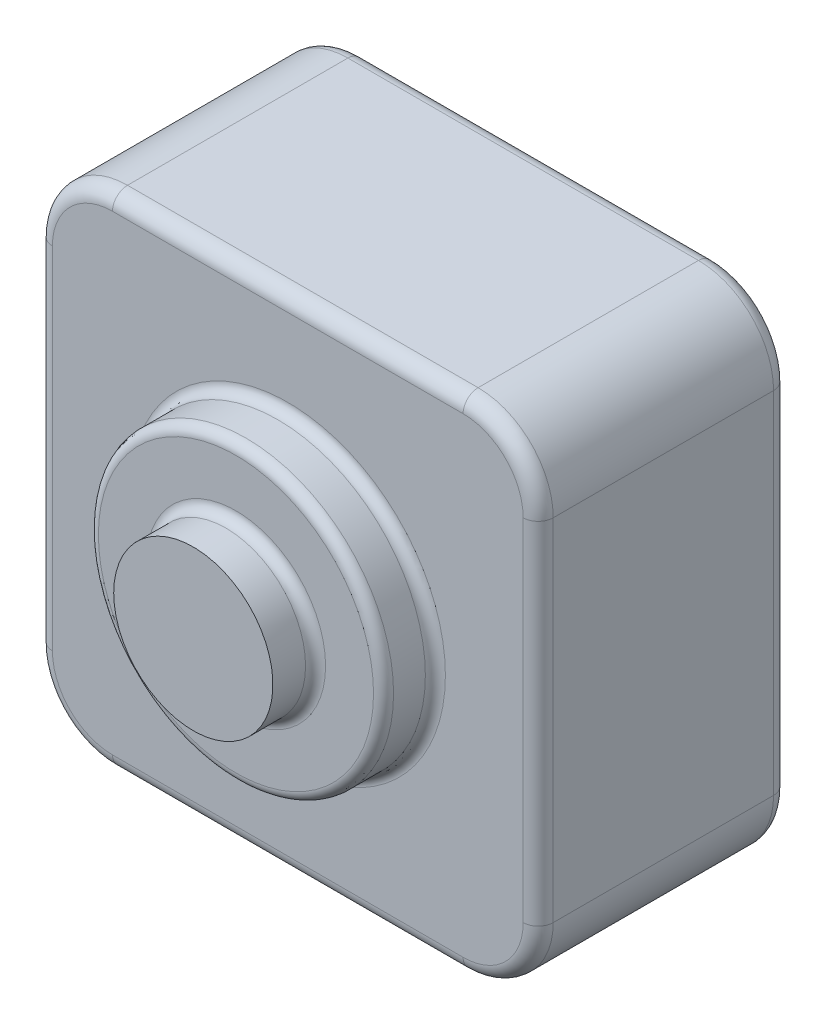
ISO-10303-21;
HEADER;
FILE_DESCRIPTION(('STEP AP214'),'2;1');
FILE_NAME('part.step','',(''),(''),'','','');
FILE_SCHEMA(('AUTOMOTIVE_DESIGN { 1 0 10303 214 1 1 1 1 }'));
ENDSEC;
DATA;
#1=APPLICATION_CONTEXT('core data for automotive mechanical design processes');
#2=APPLICATION_PROTOCOL_DEFINITION('international standard','automotive_design',2000,#1);
#3=PRODUCT_CONTEXT('',#1,'mechanical');
#4=PRODUCT('Part','Part','',(#3));
#5=PRODUCT_RELATED_PRODUCT_CATEGORY('part','',(#4));
#6=PRODUCT_DEFINITION_FORMATION('','',#4);
#7=PRODUCT_DEFINITION_CONTEXT('part definition',#1,'design');
#8=PRODUCT_DEFINITION('design','',#6,#7);
#9=PRODUCT_DEFINITION_SHAPE('','',#8);
#10=(LENGTH_UNIT() NAMED_UNIT(*) SI_UNIT(.MILLI.,.METRE.));
#11=(NAMED_UNIT(*) PLANE_ANGLE_UNIT() SI_UNIT($,.RADIAN.));
#12=(NAMED_UNIT(*) SI_UNIT($,.STERADIAN.) SOLID_ANGLE_UNIT());
#13=UNCERTAINTY_MEASURE_WITH_UNIT(LENGTH_MEASURE(1.E-05),#10,'distance_accuracy_value','');
#14=(GEOMETRIC_REPRESENTATION_CONTEXT(3) GLOBAL_UNCERTAINTY_ASSIGNED_CONTEXT((#13)) GLOBAL_UNIT_ASSIGNED_CONTEXT((#10,
#11,#12)) REPRESENTATION_CONTEXT('',''));
#15=CARTESIAN_POINT('',(0.,0.,0.));
#16=DIRECTION('',(0.,0.,1.));
#17=DIRECTION('',(1.,0.,0.));
#18=AXIS2_PLACEMENT_3D('',#15,#16,#17);
#19=CARTESIAN_POINT('',(0.,0.,68.869639975));
#20=DIRECTION('',(0.,0.,1.));
#21=DIRECTION('',(1.,0.,0.));
#22=AXIS2_PLACEMENT_3D('',#19,#20,#21);
#23=PLANE('',#22);
#24=CARTESIAN_POINT('',(0.,0.,68.869639975));
#25=DIRECTION('',(0.,0.,-1.));
#26=DIRECTION('',(-1.,0.,0.));
#27=AXIS2_PLACEMENT_3D('',#24,#25,#26);
#28=CIRCLE('',#27,15.894503155);
#29=CARTESIAN_POINT('',(-15.894503155,0.,68.869639975));
#30=VERTEX_POINT('',#29);
#31=EDGE_CURVE('E226',#30,#30,#28,.T.);
#32=ORIENTED_EDGE('',*,*,#31,.F.);
#33=EDGE_LOOP('',(#32));
#34=FACE_BOUND('',#33,.T.);
#35=ADVANCED_FACE('F17',(#34),#23,.T.);
#36=CARTESIAN_POINT('',(0.,0.,68.869639975));
#37=DIRECTION('',(0.,0.,-1.));
#38=DIRECTION('',(-1.,0.,0.));
#39=AXIS2_PLACEMENT_3D('',#36,#37,#38);
#40=CYLINDRICAL_SURFACE('',#39,15.894503155);
#41=CARTESIAN_POINT('',(0.,0.,62.348961555));
#42=DIRECTION('',(0.,0.,1.));
#43=DIRECTION('',(1.,0.,0.));
#44=AXIS2_PLACEMENT_3D('',#41,#42,#43);
#45=CIRCLE('',#44,15.894503155);
#46=CARTESIAN_POINT('',(15.894503155,0.,62.348961555));
#47=VERTEX_POINT('',#46);
#48=EDGE_CURVE('E153',#47,#47,#45,.T.);
#49=ORIENTED_EDGE('',*,*,#48,.T.);
#50=EDGE_LOOP('',(#49));
#51=FACE_BOUND('',#50,.T.);
#52=ORIENTED_EDGE('',*,*,#31,.T.);
#53=EDGE_LOOP('',(#52));
#54=FACE_BOUND('',#53,.T.);
#55=ADVANCED_FACE('F975',(#51,#54),#40,.T.);
#56=CARTESIAN_POINT('',(0.,0.,62.348961555));
#57=DIRECTION('',(0.,0.,1.));
#58=DIRECTION('',(1.,0.,0.));
#59=AXIS2_PLACEMENT_3D('',#56,#57,#58);
#60=TOROIDAL_SURFACE('',#59,17.894503155,2.);
#61=ORIENTED_EDGE('',*,*,#48,.F.);
#62=EDGE_LOOP('',(#61));
#63=FACE_BOUND('',#62,.T.);
#64=CARTESIAN_POINT('',(0.,0.,60.348961555));
#65=DIRECTION('',(0.,0.,1.));
#66=DIRECTION('',(-1.,0.,0.));
#67=AXIS2_PLACEMENT_3D('',#64,#65,#66);
#68=CIRCLE('',#67,17.894503155);
#69=CARTESIAN_POINT('',(17.894503155,0.,60.348961555));
#70=VERTEX_POINT('',#69);
#71=CARTESIAN_POINT('',(-17.894503155,0.,60.348961555));
#72=VERTEX_POINT('',#71);
#73=EDGE_CURVE('E149',#70,#72,#68,.F.);
#74=ORIENTED_EDGE('',*,*,#73,.F.);
#75=CARTESIAN_POINT('',(0.,0.,60.348961555));
#76=DIRECTION('',(0.,0.,1.));
#77=DIRECTION('',(1.,0.,0.));
#78=AXIS2_PLACEMENT_3D('',#75,#76,#77);
#79=CIRCLE('',#78,17.894503155);
#80=EDGE_CURVE('E146',#72,#70,#79,.F.);
#81=ORIENTED_EDGE('',*,*,#80,.F.);
#82=EDGE_LOOP('',(#74,#81));
#83=FACE_BOUND('',#82,.T.);
#84=ADVANCED_FACE('F150',(#63,#83),#60,.F.);
#85=CARTESIAN_POINT('',(0.,0.,60.348961555));
#86=DIRECTION('',(0.,0.,1.));
#87=DIRECTION('',(1.,0.,0.));
#88=AXIS2_PLACEMENT_3D('',#85,#86,#87);
#89=PLANE('',#88);
#90=CARTESIAN_POINT('',(0.,0.,60.348961555));
#91=DIRECTION('',(0.,0.,-1.));
#92=DIRECTION('',(-1.,0.,0.));
#93=AXIS2_PLACEMENT_3D('',#90,#91,#92);
#94=CIRCLE('',#93,27.467523);
#95=CARTESIAN_POINT('',(-27.467523,0.,60.348961555));
#96=VERTEX_POINT('',#95);
#97=CARTESIAN_POINT('',(27.467523,0.,60.348961555));
#98=VERTEX_POINT('',#97);
#99=EDGE_CURVE('E206',#96,#98,#94,.T.);
#100=ORIENTED_EDGE('',*,*,#99,.F.);
#101=CARTESIAN_POINT('',(0.,0.,60.348961555));
#102=DIRECTION('',(0.,0.,-1.));
#103=DIRECTION('',(1.,0.,0.));
#104=AXIS2_PLACEMENT_3D('',#101,#102,#103);
#105=CIRCLE('',#104,27.467523);
#106=EDGE_CURVE('E157',#98,#96,#105,.T.);
#107=ORIENTED_EDGE('',*,*,#106,.F.);
#108=EDGE_LOOP('',(#100,#107));
#109=FACE_BOUND('',#108,.T.);
#110=ORIENTED_EDGE('',*,*,#73,.T.);
#111=ORIENTED_EDGE('',*,*,#80,.T.);
#112=EDGE_LOOP('',(#110,#111));
#113=FACE_BOUND('',#112,.T.);
#114=ADVANCED_FACE('F156',(#109,#113),#89,.T.);
#115=CARTESIAN_POINT('',(0.,0.,58.348961555));
#116=DIRECTION('',(0.,0.,1.));
#117=DIRECTION('',(1.,0.,0.));
#118=AXIS2_PLACEMENT_3D('',#115,#116,#117);
#119=TOROIDAL_SURFACE('',#118,27.467523,2.);
#120=ORIENTED_EDGE('',*,*,#106,.T.);
#121=ORIENTED_EDGE('',*,*,#99,.T.);
#122=EDGE_LOOP('',(#120,#121));
#123=FACE_BOUND('',#122,.T.);
#124=CARTESIAN_POINT('',(0.,0.,58.348961555));
#125=DIRECTION('',(0.,0.,-1.));
#126=DIRECTION('',(-1.,0.,0.));
#127=AXIS2_PLACEMENT_3D('',#124,#125,#126);
#128=CIRCLE('',#127,29.467523);
#129=CARTESIAN_POINT('',(-29.467523,0.,58.348961555));
#130=VERTEX_POINT('',#129);
#131=EDGE_CURVE('E273',#130,#130,#128,.T.);
#132=ORIENTED_EDGE('',*,*,#131,.F.);
#133=EDGE_LOOP('',(#132));
#134=FACE_BOUND('',#133,.T.);
#135=ADVANCED_FACE('F176',(#123,#134),#119,.T.);
#136=CARTESIAN_POINT('',(0.,0.,60.348961555));
#137=DIRECTION('',(0.,0.,-1.));
#138=DIRECTION('',(-1.,0.,0.));
#139=AXIS2_PLACEMENT_3D('',#136,#137,#138);
#140=CYLINDRICAL_SURFACE('',#139,29.467523);
#141=CARTESIAN_POINT('',(0.,0.,52.));
#142=DIRECTION('',(0.,0.,-1.));
#143=DIRECTION('',(-1.,0.,0.));
#144=AXIS2_PLACEMENT_3D('',#141,#142,#143);
#145=CIRCLE('',#144,29.467523);
#146=CARTESIAN_POINT('',(-29.467523,0.,52.));
#147=VERTEX_POINT('',#146);
#148=EDGE_CURVE('E265',#147,#147,#145,.F.);
#149=ORIENTED_EDGE('',*,*,#148,.T.);
#150=EDGE_LOOP('',(#149));
#151=FACE_BOUND('',#150,.T.);
#152=ORIENTED_EDGE('',*,*,#131,.T.);
#153=EDGE_LOOP('',(#152));
#154=FACE_BOUND('',#153,.T.);
#155=ADVANCED_FACE('F249',(#151,#154),#140,.T.);
#156=CARTESIAN_POINT('',(0.,0.,52.));
#157=DIRECTION('',(0.,0.,-1.));
#158=DIRECTION('',(-1.,0.,0.));
#159=AXIS2_PLACEMENT_3D('',#156,#157,#158);
#160=TOROIDAL_SURFACE('',#159,31.467523,2.);
#161=CARTESIAN_POINT('',(0.,0.,50.));
#162=DIRECTION('',(0.,0.,1.));
#163=DIRECTION('',(1.,0.,0.));
#164=AXIS2_PLACEMENT_3D('',#161,#162,#163);
#165=CIRCLE('',#164,31.467523);
#166=CARTESIAN_POINT('',(31.467523,0.,50.));
#167=VERTEX_POINT('',#166);
#168=CARTESIAN_POINT('',(-31.467523,0.,50.));
#169=VERTEX_POINT('',#168);
#170=EDGE_CURVE('E261',#167,#169,#165,.T.);
#171=ORIENTED_EDGE('',*,*,#170,.T.);
#172=CARTESIAN_POINT('',(0.,0.,50.));
#173=DIRECTION('',(0.,0.,1.));
#174=DIRECTION('',(-1.,0.,0.));
#175=AXIS2_PLACEMENT_3D('',#172,#173,#174);
#176=CIRCLE('',#175,31.467523);
#177=EDGE_CURVE('E232',#169,#167,#176,.T.);
#178=ORIENTED_EDGE('',*,*,#177,.T.);
#179=EDGE_LOOP('',(#171,#178));
#180=FACE_BOUND('',#179,.T.);
#181=ORIENTED_EDGE('',*,*,#148,.F.);
#182=EDGE_LOOP('',(#181));
#183=FACE_BOUND('',#182,.T.);
#184=ADVANCED_FACE('F238',(#180,#183),#160,.F.);
#185=CARTESIAN_POINT('',(0.,0.,50.));
#186=DIRECTION('',(0.,0.,-1.));
#187=DIRECTION('',(-1.,0.,0.));
#188=AXIS2_PLACEMENT_3D('',#185,#186,#187);
#189=PLANE('',#188);
#190=CARTESIAN_POINT('',(-35.,-35.,50.));
#191=DIRECTION('',(0.,0.,-1.));
#192=DIRECTION('',(0.,-1.,0.));
#193=AXIS2_PLACEMENT_3D('',#190,#191,#192);
#194=CIRCLE('',#193,12.);
#195=CARTESIAN_POINT('',(-35.,-47.,50.));
#196=VERTEX_POINT('',#195);
#197=CARTESIAN_POINT('',(-47.,-35.,50.));
#198=VERTEX_POINT('',#197);
#199=EDGE_CURVE('E637',#196,#198,#194,.T.);
#200=ORIENTED_EDGE('',*,*,#199,.F.);
#201=DIRECTION('',(1.,0.,0.));
#202=VECTOR('',#201,1.);
#203=CARTESIAN_POINT('',(0.,-47.,50.));
#204=LINE('',#203,#202);
#205=CARTESIAN_POINT('',(35.,-47.,50.));
#206=VERTEX_POINT('',#205);
#207=EDGE_CURVE('E675',#206,#196,#204,.F.);
#208=ORIENTED_EDGE('',*,*,#207,.F.);
#209=CARTESIAN_POINT('',(35.,-35.,50.));
#210=DIRECTION('',(0.,0.,-1.));
#211=DIRECTION('',(1.,0.,0.));
#212=AXIS2_PLACEMENT_3D('',#209,#210,#211);
#213=CIRCLE('',#212,12.);
#214=CARTESIAN_POINT('',(47.,-35.,50.));
#215=VERTEX_POINT('',#214);
#216=EDGE_CURVE('E699',#215,#206,#213,.T.);
#217=ORIENTED_EDGE('',*,*,#216,.F.);
#218=DIRECTION('',(0.,1.,0.));
#219=VECTOR('',#218,1.);
#220=CARTESIAN_POINT('',(47.,0.,50.));
#221=LINE('',#220,#219);
#222=CARTESIAN_POINT('',(47.,35.,50.));
#223=VERTEX_POINT('',#222);
#224=EDGE_CURVE('E553',#223,#215,#221,.F.);
#225=ORIENTED_EDGE('',*,*,#224,.F.);
#226=CARTESIAN_POINT('',(35.,35.,50.));
#227=DIRECTION('',(0.,0.,-1.));
#228=DIRECTION('',(0.,1.,0.));
#229=AXIS2_PLACEMENT_3D('',#226,#227,#228);
#230=CIRCLE('',#229,12.);
#231=CARTESIAN_POINT('',(35.,47.,50.));
#232=VERTEX_POINT('',#231);
#233=EDGE_CURVE('E568',#232,#223,#230,.T.);
#234=ORIENTED_EDGE('',*,*,#233,.F.);
#235=DIRECTION('',(-1.,0.,0.));
#236=VECTOR('',#235,1.);
#237=CARTESIAN_POINT('',(0.,47.,50.));
#238=LINE('',#237,#236);
#239=CARTESIAN_POINT('',(-35.,47.,50.));
#240=VERTEX_POINT('',#239);
#241=EDGE_CURVE('E573',#240,#232,#238,.F.);
#242=ORIENTED_EDGE('',*,*,#241,.F.);
#243=CARTESIAN_POINT('',(-35.,35.,50.));
#244=DIRECTION('',(0.,0.,-1.));
#245=DIRECTION('',(-1.,0.,0.));
#246=AXIS2_PLACEMENT_3D('',#243,#244,#245);
#247=CIRCLE('',#246,12.);
#248=CARTESIAN_POINT('',(-47.,35.,50.));
#249=VERTEX_POINT('',#248);
#250=EDGE_CURVE('E607',#249,#240,#247,.T.);
#251=ORIENTED_EDGE('',*,*,#250,.F.);
#252=DIRECTION('',(0.,-1.,0.));
#253=VECTOR('',#252,1.);
#254=CARTESIAN_POINT('',(-47.,0.,50.));
#255=LINE('',#254,#253);
#256=EDGE_CURVE('E625',#198,#249,#255,.F.);
#257=ORIENTED_EDGE('',*,*,#256,.F.);
#258=EDGE_LOOP('',(#200,#208,#217,#225,#234,#242,#251,#257));
#259=FACE_BOUND('',#258,.T.);
#260=ORIENTED_EDGE('',*,*,#177,.F.);
#261=ORIENTED_EDGE('',*,*,#170,.F.);
#262=EDGE_LOOP('',(#260,#261));
#263=FACE_BOUND('',#262,.T.);
#264=ADVANCED_FACE('F248',(#259,#263),#189,.F.);
#265=CARTESIAN_POINT('',(0.,-47.,47.));
#266=DIRECTION('',(1.,0.,0.));
#267=DIRECTION('',(0.,0.,-1.));
#268=AXIS2_PLACEMENT_3D('',#265,#266,#267);
#269=CYLINDRICAL_SURFACE('',#268,3.);
#270=CARTESIAN_POINT('',(-35.,-47.,47.));
#271=DIRECTION('',(-1.,0.,0.));
#272=DIRECTION('',(0.,-1.,0.));
#273=AXIS2_PLACEMENT_3D('',#270,#271,#272);
#274=CIRCLE('',#273,3.);
#275=CARTESIAN_POINT('',(-35.,-50.,47.));
#276=VERTEX_POINT('',#275);
#277=EDGE_CURVE('E643',#276,#196,#274,.T.);
#278=ORIENTED_EDGE('',*,*,#277,.F.);
#279=DIRECTION('',(1.,0.,0.));
#280=VECTOR('',#279,1.);
#281=CARTESIAN_POINT('',(-50.,-50.,47.));
#282=LINE('',#281,#280);
#283=CARTESIAN_POINT('',(35.,-50.,47.));
#284=VERTEX_POINT('',#283);
#285=EDGE_CURVE('E529',#276,#284,#282,.T.);
#286=ORIENTED_EDGE('',*,*,#285,.T.);
#287=CARTESIAN_POINT('',(35.,-47.,47.));
#288=DIRECTION('',(-1.,0.,0.));
#289=DIRECTION('',(0.,-1.,0.));
#290=AXIS2_PLACEMENT_3D('',#287,#288,#289);
#291=CIRCLE('',#290,3.);
#292=EDGE_CURVE('E678',#206,#284,#291,.F.);
#293=ORIENTED_EDGE('',*,*,#292,.F.);
#294=ORIENTED_EDGE('',*,*,#207,.T.);
#295=EDGE_LOOP('',(#278,#286,#293,#294));
#296=FACE_BOUND('',#295,.T.);
#297=ADVANCED_FACE('F666',(#296),#269,.T.);
#298=CARTESIAN_POINT('',(-35.,-35.,47.));
#299=DIRECTION('',(0.,0.,-1.));
#300=DIRECTION('',(-1.,0.,0.));
#301=AXIS2_PLACEMENT_3D('',#298,#299,#300);
#302=TOROIDAL_SURFACE('',#301,12.,3.);
#303=ORIENTED_EDGE('',*,*,#277,.T.);
#304=ORIENTED_EDGE('',*,*,#199,.T.);
#305=CARTESIAN_POINT('',(-47.,-35.,47.));
#306=DIRECTION('',(0.,-1.,0.));
#307=DIRECTION('',(0.,0.,-1.));
#308=AXIS2_PLACEMENT_3D('',#305,#306,#307);
#309=CIRCLE('',#308,3.);
#310=CARTESIAN_POINT('',(-50.,-35.,47.));
#311=VERTEX_POINT('',#310);
#312=EDGE_CURVE('E632',#311,#198,#309,.F.);
#313=ORIENTED_EDGE('',*,*,#312,.F.);
#314=CARTESIAN_POINT('',(-35.,-35.,47.));
#315=DIRECTION('',(0.,0.,-1.));
#316=DIRECTION('',(-1.,0.,0.));
#317=AXIS2_PLACEMENT_3D('',#314,#315,#316);
#318=CIRCLE('',#317,15.);
#319=EDGE_CURVE('E528',#276,#311,#318,.T.);
#320=ORIENTED_EDGE('',*,*,#319,.F.);
#321=EDGE_LOOP('',(#303,#304,#313,#320));
#322=FACE_BOUND('',#321,.T.);
#323=ADVANCED_FACE('F639',(#322),#302,.T.);
#324=CARTESIAN_POINT('',(-47.,0.,47.));
#325=DIRECTION('',(0.,-1.,0.));
#326=DIRECTION('',(0.,0.,-1.));
#327=AXIS2_PLACEMENT_3D('',#324,#325,#326);
#328=CYLINDRICAL_SURFACE('',#327,3.);
#329=ORIENTED_EDGE('',*,*,#312,.T.);
#330=ORIENTED_EDGE('',*,*,#256,.T.);
#331=CARTESIAN_POINT('',(-47.,35.,47.));
#332=DIRECTION('',(0.,1.,0.));
#333=DIRECTION('',(-1.,0.,0.));
#334=AXIS2_PLACEMENT_3D('',#331,#332,#333);
#335=CIRCLE('',#334,3.);
#336=CARTESIAN_POINT('',(-50.,35.,47.));
#337=VERTEX_POINT('',#336);
#338=EDGE_CURVE('E612',#337,#249,#335,.T.);
#339=ORIENTED_EDGE('',*,*,#338,.F.);
#340=DIRECTION('',(0.,1.,0.));
#341=VECTOR('',#340,1.);
#342=CARTESIAN_POINT('',(-50.,-50.,47.));
#343=LINE('',#342,#341);
#344=EDGE_CURVE('E518',#337,#311,#343,.F.);
#345=ORIENTED_EDGE('',*,*,#344,.T.);
#346=EDGE_LOOP('',(#329,#330,#339,#345));
#347=FACE_BOUND('',#346,.T.);
#348=ADVANCED_FACE('F618',(#347),#328,.T.);
#349=CARTESIAN_POINT('',(-35.,35.,47.));
#350=DIRECTION('',(0.,0.,-1.));
#351=DIRECTION('',(-1.,0.,0.));
#352=AXIS2_PLACEMENT_3D('',#349,#350,#351);
#353=TOROIDAL_SURFACE('',#352,12.,3.);
#354=ORIENTED_EDGE('',*,*,#338,.T.);
#355=ORIENTED_EDGE('',*,*,#250,.T.);
#356=CARTESIAN_POINT('',(-35.,47.,47.));
#357=DIRECTION('',(-1.,0.,0.));
#358=DIRECTION('',(0.,0.,1.));
#359=AXIS2_PLACEMENT_3D('',#356,#357,#358);
#360=CIRCLE('',#359,3.);
#361=CARTESIAN_POINT('',(-35.,50.,47.));
#362=VERTEX_POINT('',#361);
#363=EDGE_CURVE('E604',#362,#240,#360,.F.);
#364=ORIENTED_EDGE('',*,*,#363,.F.);
#365=CARTESIAN_POINT('',(-35.,35.,47.));
#366=DIRECTION('',(0.,0.,-1.));
#367=DIRECTION('',(-1.,0.,0.));
#368=AXIS2_PLACEMENT_3D('',#365,#366,#367);
#369=CIRCLE('',#368,15.);
#370=EDGE_CURVE('E509',#337,#362,#369,.T.);
#371=ORIENTED_EDGE('',*,*,#370,.F.);
#372=EDGE_LOOP('',(#354,#355,#364,#371));
#373=FACE_BOUND('',#372,.T.);
#374=ADVANCED_FACE('F614',(#373),#353,.T.);
#375=CARTESIAN_POINT('',(0.,47.,47.));
#376=DIRECTION('',(-1.,0.,0.));
#377=DIRECTION('',(0.,0.,1.));
#378=AXIS2_PLACEMENT_3D('',#375,#376,#377);
#379=CYLINDRICAL_SURFACE('',#378,3.);
#380=ORIENTED_EDGE('',*,*,#363,.T.);
#381=ORIENTED_EDGE('',*,*,#241,.T.);
#382=CARTESIAN_POINT('',(35.,47.,47.));
#383=DIRECTION('',(1.,0.,0.));
#384=DIRECTION('',(0.,1.,0.));
#385=AXIS2_PLACEMENT_3D('',#382,#383,#384);
#386=CIRCLE('',#385,3.);
#387=CARTESIAN_POINT('',(35.,50.,47.));
#388=VERTEX_POINT('',#387);
#389=EDGE_CURVE('E592',#388,#232,#386,.T.);
#390=ORIENTED_EDGE('',*,*,#389,.F.);
#391=DIRECTION('',(1.,0.,0.));
#392=VECTOR('',#391,1.);
#393=CARTESIAN_POINT('',(-50.,50.,47.));
#394=LINE('',#393,#392);
#395=EDGE_CURVE('E499',#388,#362,#394,.F.);
#396=ORIENTED_EDGE('',*,*,#395,.T.);
#397=EDGE_LOOP('',(#380,#381,#390,#396));
#398=FACE_BOUND('',#397,.T.);
#399=ADVANCED_FACE('F585',(#398),#379,.T.);
#400=CARTESIAN_POINT('',(35.,35.,47.));
#401=DIRECTION('',(0.,0.,-1.));
#402=DIRECTION('',(-1.,0.,0.));
#403=AXIS2_PLACEMENT_3D('',#400,#401,#402);
#404=TOROIDAL_SURFACE('',#403,12.,3.);
#405=ORIENTED_EDGE('',*,*,#389,.T.);
#406=ORIENTED_EDGE('',*,*,#233,.T.);
#407=CARTESIAN_POINT('',(47.,35.,47.));
#408=DIRECTION('',(0.,1.,0.));
#409=DIRECTION('',(0.,0.,1.));
#410=AXIS2_PLACEMENT_3D('',#407,#408,#409);
#411=CIRCLE('',#410,3.);
#412=CARTESIAN_POINT('',(50.,35.,47.));
#413=VERTEX_POINT('',#412);
#414=EDGE_CURVE('E561',#413,#223,#411,.F.);
#415=ORIENTED_EDGE('',*,*,#414,.F.);
#416=CARTESIAN_POINT('',(35.,35.,47.));
#417=DIRECTION('',(0.,0.,-1.));
#418=DIRECTION('',(-1.,0.,0.));
#419=AXIS2_PLACEMENT_3D('',#416,#417,#418);
#420=CIRCLE('',#419,15.);
#421=EDGE_CURVE('E490',#388,#413,#420,.T.);
#422=ORIENTED_EDGE('',*,*,#421,.F.);
#423=EDGE_LOOP('',(#405,#406,#415,#422));
#424=FACE_BOUND('',#423,.T.);
#425=ADVANCED_FACE('F575',(#424),#404,.T.);
#426=CARTESIAN_POINT('',(47.,0.,47.));
#427=DIRECTION('',(0.,1.,0.));
#428=DIRECTION('',(0.,0.,1.));
#429=AXIS2_PLACEMENT_3D('',#426,#427,#428);
#430=CYLINDRICAL_SURFACE('',#429,3.);
#431=CARTESIAN_POINT('',(47.,-35.,47.));
#432=DIRECTION('',(0.,-1.,0.));
#433=DIRECTION('',(1.,0.,0.));
#434=AXIS2_PLACEMENT_3D('',#431,#432,#433);
#435=CIRCLE('',#434,3.);
#436=CARTESIAN_POINT('',(50.,-35.,47.));
#437=VERTEX_POINT('',#436);
#438=EDGE_CURVE('E560',#437,#215,#435,.T.);
#439=ORIENTED_EDGE('',*,*,#438,.F.);
#440=DIRECTION('',(0.,1.,0.));
#441=VECTOR('',#440,1.);
#442=CARTESIAN_POINT('',(50.,-50.,47.));
#443=LINE('',#442,#441);
#444=EDGE_CURVE('E480',#437,#413,#443,.T.);
#445=ORIENTED_EDGE('',*,*,#444,.T.);
#446=ORIENTED_EDGE('',*,*,#414,.T.);
#447=ORIENTED_EDGE('',*,*,#224,.T.);
#448=EDGE_LOOP('',(#439,#445,#446,#447));
#449=FACE_BOUND('',#448,.T.);
#450=ADVANCED_FACE('F542',(#449),#430,.T.);
#451=CARTESIAN_POINT('',(35.,-35.,47.));
#452=DIRECTION('',(0.,0.,-1.));
#453=DIRECTION('',(-1.,0.,0.));
#454=AXIS2_PLACEMENT_3D('',#451,#452,#453);
#455=TOROIDAL_SURFACE('',#454,12.,3.);
#456=ORIENTED_EDGE('',*,*,#292,.T.);
#457=CARTESIAN_POINT('',(35.,-35.,47.));
#458=DIRECTION('',(0.,0.,-1.));
#459=DIRECTION('',(-1.,0.,0.));
#460=AXIS2_PLACEMENT_3D('',#457,#458,#459);
#461=CIRCLE('',#460,15.);
#462=EDGE_CURVE('E459',#437,#284,#461,.T.);
#463=ORIENTED_EDGE('',*,*,#462,.F.);
#464=ORIENTED_EDGE('',*,*,#438,.T.);
#465=ORIENTED_EDGE('',*,*,#216,.T.);
#466=EDGE_LOOP('',(#456,#463,#464,#465));
#467=FACE_BOUND('',#466,.T.);
#468=ADVANCED_FACE('F536',(#467),#455,.T.);
#469=CARTESIAN_POINT('',(-50.,-50.,50.));
#470=DIRECTION('',(0.,1.,0.));
#471=DIRECTION('',(0.,0.,1.));
#472=AXIS2_PLACEMENT_3D('',#469,#470,#471);
#473=PLANE('',#472);
#474=DIRECTION('',(-1.,0.,0.));
#475=VECTOR('',#474,1.);
#476=CARTESIAN_POINT('',(-50.,-50.,3.));
#477=LINE('',#476,#475);
#478=CARTESIAN_POINT('',(35.,-50.,3.));
#479=VERTEX_POINT('',#478);
#480=CARTESIAN_POINT('',(-35.,-50.,3.));
#481=VERTEX_POINT('',#480);
#482=EDGE_CURVE('E454',#479,#481,#477,.T.);
#483=ORIENTED_EDGE('',*,*,#482,.F.);
#484=DIRECTION('',(0.,0.,-1.));
#485=VECTOR('',#484,1.);
#486=CARTESIAN_POINT('',(35.,-50.,50.));
#487=LINE('',#486,#485);
#488=EDGE_CURVE('E465',#284,#479,#487,.T.);
#489=ORIENTED_EDGE('',*,*,#488,.F.);
#490=ORIENTED_EDGE('',*,*,#285,.F.);
#491=DIRECTION('',(0.,0.,-1.));
#492=VECTOR('',#491,1.);
#493=CARTESIAN_POINT('',(-35.,-50.,50.));
#494=LINE('',#493,#492);
#495=EDGE_CURVE('E525',#481,#276,#494,.F.);
#496=ORIENTED_EDGE('',*,*,#495,.F.);
#497=EDGE_LOOP('',(#483,#489,#490,#496));
#498=FACE_BOUND('',#497,.T.);
#499=ADVANCED_FACE('F541',(#498),#473,.F.);
#500=CARTESIAN_POINT('',(-35.,-35.,50.));
#501=DIRECTION('',(0.,0.,-1.));
#502=DIRECTION('',(-1.,0.,0.));
#503=AXIS2_PLACEMENT_3D('',#500,#501,#502);
#504=CYLINDRICAL_SURFACE('',#503,15.);
#505=ORIENTED_EDGE('',*,*,#495,.T.);
#506=ORIENTED_EDGE('',*,*,#319,.T.);
#507=DIRECTION('',(0.,0.,-1.));
#508=VECTOR('',#507,1.);
#509=CARTESIAN_POINT('',(-50.,-35.,50.));
#510=LINE('',#509,#508);
#511=CARTESIAN_POINT('',(-50.,-35.,3.));
#512=VERTEX_POINT('',#511);
#513=EDGE_CURVE('E510',#311,#512,#510,.T.);
#514=ORIENTED_EDGE('',*,*,#513,.T.);
#515=CARTESIAN_POINT('',(-35.,-35.,3.));
#516=DIRECTION('',(0.,0.,-1.));
#517=DIRECTION('',(-1.,0.,0.));
#518=AXIS2_PLACEMENT_3D('',#515,#516,#517);
#519=CIRCLE('',#518,15.);
#520=EDGE_CURVE('E429',#481,#512,#519,.T.);
#521=ORIENTED_EDGE('',*,*,#520,.F.);
#522=EDGE_LOOP('',(#505,#506,#514,#521));
#523=FACE_BOUND('',#522,.T.);
#524=ADVANCED_FACE('F683',(#523),#504,.T.);
#525=CARTESIAN_POINT('',(-50.,-50.,50.));
#526=DIRECTION('',(1.,0.,0.));
#527=DIRECTION('',(0.,0.,-1.));
#528=AXIS2_PLACEMENT_3D('',#525,#526,#527);
#529=PLANE('',#528);
#530=DIRECTION('',(0.,1.,0.));
#531=VECTOR('',#530,1.);
#532=CARTESIAN_POINT('',(-50.,-50.,3.));
#533=LINE('',#532,#531);
#534=CARTESIAN_POINT('',(-50.,35.,3.));
#535=VERTEX_POINT('',#534);
#536=EDGE_CURVE('E423',#512,#535,#533,.T.);
#537=ORIENTED_EDGE('',*,*,#536,.F.);
#538=ORIENTED_EDGE('',*,*,#513,.F.);
#539=ORIENTED_EDGE('',*,*,#344,.F.);
#540=DIRECTION('',(0.,0.,-1.));
#541=VECTOR('',#540,1.);
#542=CARTESIAN_POINT('',(-50.,35.,50.));
#543=LINE('',#542,#541);
#544=EDGE_CURVE('E506',#535,#337,#543,.F.);
#545=ORIENTED_EDGE('',*,*,#544,.F.);
#546=EDGE_LOOP('',(#537,#538,#539,#545));
#547=FACE_BOUND('',#546,.T.);
#548=ADVANCED_FACE('F780',(#547),#529,.F.);
#549=CARTESIAN_POINT('',(-35.,35.,50.));
#550=DIRECTION('',(0.,0.,-1.));
#551=DIRECTION('',(-1.,0.,0.));
#552=AXIS2_PLACEMENT_3D('',#549,#550,#551);
#553=CYLINDRICAL_SURFACE('',#552,15.);
#554=ORIENTED_EDGE('',*,*,#544,.T.);
#555=ORIENTED_EDGE('',*,*,#370,.T.);
#556=DIRECTION('',(0.,0.,-1.));
#557=VECTOR('',#556,1.);
#558=CARTESIAN_POINT('',(-35.,50.,50.));
#559=LINE('',#558,#557);
#560=CARTESIAN_POINT('',(-35.,50.,3.));
#561=VERTEX_POINT('',#560);
#562=EDGE_CURVE('E491',#362,#561,#559,.T.);
#563=ORIENTED_EDGE('',*,*,#562,.T.);
#564=CARTESIAN_POINT('',(-35.,35.,3.));
#565=DIRECTION('',(0.,0.,-1.));
#566=DIRECTION('',(-1.,0.,0.));
#567=AXIS2_PLACEMENT_3D('',#564,#565,#566);
#568=CIRCLE('',#567,15.);
#569=EDGE_CURVE('E398',#535,#561,#568,.T.);
#570=ORIENTED_EDGE('',*,*,#569,.F.);
#571=EDGE_LOOP('',(#554,#555,#563,#570));
#572=FACE_BOUND('',#571,.T.);
#573=ADVANCED_FACE('F732',(#572),#553,.T.);
#574=CARTESIAN_POINT('',(-50.,50.,50.));
#575=DIRECTION('',(0.,-1.,0.));
#576=DIRECTION('',(0.,0.,-1.));
#577=AXIS2_PLACEMENT_3D('',#574,#575,#576);
#578=PLANE('',#577);
#579=DIRECTION('',(1.,0.,0.));
#580=VECTOR('',#579,1.);
#581=CARTESIAN_POINT('',(-50.,50.,3.));
#582=LINE('',#581,#580);
#583=CARTESIAN_POINT('',(35.,50.,3.));
#584=VERTEX_POINT('',#583);
#585=EDGE_CURVE('E392',#561,#584,#582,.T.);
#586=ORIENTED_EDGE('',*,*,#585,.F.);
#587=ORIENTED_EDGE('',*,*,#562,.F.);
#588=ORIENTED_EDGE('',*,*,#395,.F.);
#589=DIRECTION('',(0.,0.,-1.));
#590=VECTOR('',#589,1.);
#591=CARTESIAN_POINT('',(35.,50.,50.));
#592=LINE('',#591,#590);
#593=EDGE_CURVE('E487',#584,#388,#592,.F.);
#594=ORIENTED_EDGE('',*,*,#593,.F.);
#595=EDGE_LOOP('',(#586,#587,#588,#594));
#596=FACE_BOUND('',#595,.T.);
#597=ADVANCED_FACE('F723',(#596),#578,.F.);
#598=CARTESIAN_POINT('',(35.,35.,50.));
#599=DIRECTION('',(0.,0.,-1.));
#600=DIRECTION('',(-1.,0.,0.));
#601=AXIS2_PLACEMENT_3D('',#598,#599,#600);
#602=CYLINDRICAL_SURFACE('',#601,15.);
#603=ORIENTED_EDGE('',*,*,#593,.T.);
#604=ORIENTED_EDGE('',*,*,#421,.T.);
#605=DIRECTION('',(0.,0.,1.));
#606=VECTOR('',#605,1.);
#607=CARTESIAN_POINT('',(50.,35.,50.));
#608=LINE('',#607,#606);
#609=CARTESIAN_POINT('',(50.,35.,3.));
#610=VERTEX_POINT('',#609);
#611=EDGE_CURVE('E469',#413,#610,#608,.F.);
#612=ORIENTED_EDGE('',*,*,#611,.T.);
#613=CARTESIAN_POINT('',(35.,35.,3.));
#614=DIRECTION('',(0.,0.,-1.));
#615=DIRECTION('',(-1.,0.,0.));
#616=AXIS2_PLACEMENT_3D('',#613,#614,#615);
#617=CIRCLE('',#616,15.);
#618=EDGE_CURVE('E367',#584,#610,#617,.T.);
#619=ORIENTED_EDGE('',*,*,#618,.F.);
#620=EDGE_LOOP('',(#603,#604,#612,#619));
#621=FACE_BOUND('',#620,.T.);
#622=ADVANCED_FACE('F719',(#621),#602,.T.);
#623=CARTESIAN_POINT('',(50.,-50.,50.));
#624=DIRECTION('',(-1.,0.,0.));
#625=DIRECTION('',(0.,0.,1.));
#626=AXIS2_PLACEMENT_3D('',#623,#624,#625);
#627=PLANE('',#626);
#628=DIRECTION('',(0.,-1.,0.));
#629=VECTOR('',#628,1.);
#630=CARTESIAN_POINT('',(50.,-50.,3.));
#631=LINE('',#630,#629);
#632=CARTESIAN_POINT('',(50.,-35.,3.));
#633=VERTEX_POINT('',#632);
#634=EDGE_CURVE('E361',#610,#633,#631,.T.);
#635=ORIENTED_EDGE('',*,*,#634,.F.);
#636=ORIENTED_EDGE('',*,*,#611,.F.);
#637=ORIENTED_EDGE('',*,*,#444,.F.);
#638=DIRECTION('',(0.,0.,-1.));
#639=VECTOR('',#638,1.);
#640=CARTESIAN_POINT('',(50.,-35.,50.));
#641=LINE('',#640,#639);
#642=EDGE_CURVE('E468',#633,#437,#641,.F.);
#643=ORIENTED_EDGE('',*,*,#642,.F.);
#644=EDGE_LOOP('',(#635,#636,#637,#643));
#645=FACE_BOUND('',#644,.T.);
#646=ADVANCED_FACE('F765',(#645),#627,.F.);
#647=CARTESIAN_POINT('',(35.,-35.,50.));
#648=DIRECTION('',(0.,0.,-1.));
#649=DIRECTION('',(-1.,0.,0.));
#650=AXIS2_PLACEMENT_3D('',#647,#648,#649);
#651=CYLINDRICAL_SURFACE('',#650,15.);
#652=ORIENTED_EDGE('',*,*,#642,.T.);
#653=ORIENTED_EDGE('',*,*,#462,.T.);
#654=ORIENTED_EDGE('',*,*,#488,.T.);
#655=CARTESIAN_POINT('',(35.,-35.,3.));
#656=DIRECTION('',(0.,0.,-1.));
#657=DIRECTION('',(-1.,0.,0.));
#658=AXIS2_PLACEMENT_3D('',#655,#656,#657);
#659=CIRCLE('',#658,15.);
#660=EDGE_CURVE('E357',#633,#479,#659,.T.);
#661=ORIENTED_EDGE('',*,*,#660,.F.);
#662=EDGE_LOOP('',(#652,#653,#654,#661));
#663=FACE_BOUND('',#662,.T.);
#664=ADVANCED_FACE('F690',(#663),#651,.T.);
#665=CARTESIAN_POINT('',(-50.,-47.,3.));
#666=DIRECTION('',(-1.,0.,0.));
#667=DIRECTION('',(0.,0.,1.));
#668=AXIS2_PLACEMENT_3D('',#665,#666,#667);
#669=CYLINDRICAL_SURFACE('',#668,3.);
#670=CARTESIAN_POINT('',(-35.,-47.,3.));
#671=DIRECTION('',(-1.,0.,0.));
#672=DIRECTION('',(0.,-1.,0.));
#673=AXIS2_PLACEMENT_3D('',#670,#671,#672);
#674=CIRCLE('',#673,3.);
#675=CARTESIAN_POINT('',(-35.,-47.,0.));
#676=VERTEX_POINT('',#675);
#677=EDGE_CURVE('E446',#676,#481,#674,.T.);
#678=ORIENTED_EDGE('',*,*,#677,.F.);
#679=DIRECTION('',(-1.,0.,0.));
#680=VECTOR('',#679,1.);
#681=CARTESIAN_POINT('',(0.,-47.,0.));
#682=LINE('',#681,#680);
#683=CARTESIAN_POINT('',(35.,-47.,0.));
#684=VERTEX_POINT('',#683);
#685=EDGE_CURVE('E339',#684,#676,#682,.T.);
#686=ORIENTED_EDGE('',*,*,#685,.F.);
#687=CARTESIAN_POINT('',(35.,-47.,3.));
#688=DIRECTION('',(-1.,0.,0.));
#689=DIRECTION('',(0.,-1.,0.));
#690=AXIS2_PLACEMENT_3D('',#687,#688,#689);
#691=CIRCLE('',#690,3.);
#692=EDGE_CURVE('E344',#479,#684,#691,.F.);
#693=ORIENTED_EDGE('',*,*,#692,.F.);
#694=ORIENTED_EDGE('',*,*,#482,.T.);
#695=EDGE_LOOP('',(#678,#686,#693,#694));
#696=FACE_BOUND('',#695,.T.);
#697=ADVANCED_FACE('F440',(#696),#669,.T.);
#698=CARTESIAN_POINT('',(-35.,-35.,3.));
#699=DIRECTION('',(0.,0.,-1.));
#700=DIRECTION('',(-1.,0.,0.));
#701=AXIS2_PLACEMENT_3D('',#698,#699,#700);
#702=TOROIDAL_SURFACE('',#701,12.,3.);
#703=CARTESIAN_POINT('',(-47.,-35.,3.));
#704=DIRECTION('',(0.,1.,0.));
#705=DIRECTION('',(0.,0.,1.));
#706=AXIS2_PLACEMENT_3D('',#703,#704,#705);
#707=CIRCLE('',#706,3.);
#708=CARTESIAN_POINT('',(-47.,-35.,0.));
#709=VERTEX_POINT('',#708);
#710=EDGE_CURVE('E426',#709,#512,#707,.T.);
#711=ORIENTED_EDGE('',*,*,#710,.F.);
#712=CARTESIAN_POINT('',(-35.,-35.,0.));
#713=DIRECTION('',(0.,0.,1.));
#714=DIRECTION('',(-1.,0.,0.));
#715=AXIS2_PLACEMENT_3D('',#712,#713,#714);
#716=CIRCLE('',#715,12.);
#717=EDGE_CURVE('E685',#676,#709,#716,.F.);
#718=ORIENTED_EDGE('',*,*,#717,.F.);
#719=ORIENTED_EDGE('',*,*,#677,.T.);
#720=ORIENTED_EDGE('',*,*,#520,.T.);
#721=EDGE_LOOP('',(#711,#718,#719,#720));
#722=FACE_BOUND('',#721,.T.);
#723=ADVANCED_FACE('F436',(#722),#702,.T.);
#724=CARTESIAN_POINT('',(-47.,-50.,3.));
#725=DIRECTION('',(0.,1.,0.));
#726=DIRECTION('',(0.,0.,1.));
#727=AXIS2_PLACEMENT_3D('',#724,#725,#726);
#728=CYLINDRICAL_SURFACE('',#727,3.);
#729=ORIENTED_EDGE('',*,*,#710,.T.);
#730=ORIENTED_EDGE('',*,*,#536,.T.);
#731=CARTESIAN_POINT('',(-47.,35.,3.));
#732=DIRECTION('',(0.,1.,0.));
#733=DIRECTION('',(-1.,0.,0.));
#734=AXIS2_PLACEMENT_3D('',#731,#732,#733);
#735=CIRCLE('',#734,3.);
#736=CARTESIAN_POINT('',(-47.,35.,0.));
#737=VERTEX_POINT('',#736);
#738=EDGE_CURVE('E415',#737,#535,#735,.T.);
#739=ORIENTED_EDGE('',*,*,#738,.F.);
#740=DIRECTION('',(0.,1.,0.));
#741=VECTOR('',#740,1.);
#742=CARTESIAN_POINT('',(-47.,0.,0.));
#743=LINE('',#742,#741);
#744=EDGE_CURVE('E767',#709,#737,#743,.T.);
#745=ORIENTED_EDGE('',*,*,#744,.F.);
#746=EDGE_LOOP('',(#729,#730,#739,#745));
#747=FACE_BOUND('',#746,.T.);
#748=ADVANCED_FACE('F409',(#747),#728,.T.);
#749=CARTESIAN_POINT('',(-35.,35.,3.));
#750=DIRECTION('',(0.,0.,-1.));
#751=DIRECTION('',(-1.,0.,0.));
#752=AXIS2_PLACEMENT_3D('',#749,#750,#751);
#753=TOROIDAL_SURFACE('',#752,12.,3.);
#754=ORIENTED_EDGE('',*,*,#738,.T.);
#755=ORIENTED_EDGE('',*,*,#569,.T.);
#756=CARTESIAN_POINT('',(-35.,47.,3.));
#757=DIRECTION('',(1.,0.,0.));
#758=DIRECTION('',(0.,0.,-1.));
#759=AXIS2_PLACEMENT_3D('',#756,#757,#758);
#760=CIRCLE('',#759,3.);
#761=CARTESIAN_POINT('',(-35.,47.,0.));
#762=VERTEX_POINT('',#761);
#763=EDGE_CURVE('E395',#762,#561,#760,.T.);
#764=ORIENTED_EDGE('',*,*,#763,.F.);
#765=CARTESIAN_POINT('',(-35.,35.,0.));
#766=DIRECTION('',(0.,0.,1.));
#767=DIRECTION('',(0.,1.,0.));
#768=AXIS2_PLACEMENT_3D('',#765,#766,#767);
#769=CIRCLE('',#768,12.);
#770=EDGE_CURVE('E728',#737,#762,#769,.F.);
#771=ORIENTED_EDGE('',*,*,#770,.F.);
#772=EDGE_LOOP('',(#754,#755,#764,#771));
#773=FACE_BOUND('',#772,.T.);
#774=ADVANCED_FACE('F405',(#773),#753,.T.);
#775=CARTESIAN_POINT('',(-50.,47.,3.));
#776=DIRECTION('',(1.,0.,0.));
#777=DIRECTION('',(0.,0.,-1.));
#778=AXIS2_PLACEMENT_3D('',#775,#776,#777);
#779=CYLINDRICAL_SURFACE('',#778,3.);
#780=ORIENTED_EDGE('',*,*,#763,.T.);
#781=ORIENTED_EDGE('',*,*,#585,.T.);
#782=CARTESIAN_POINT('',(35.,47.,3.));
#783=DIRECTION('',(1.,0.,0.));
#784=DIRECTION('',(0.,1.,0.));
#785=AXIS2_PLACEMENT_3D('',#782,#783,#784);
#786=CIRCLE('',#785,3.);
#787=CARTESIAN_POINT('',(35.,47.,0.));
#788=VERTEX_POINT('',#787);
#789=EDGE_CURVE('E384',#788,#584,#786,.T.);
#790=ORIENTED_EDGE('',*,*,#789,.F.);
#791=DIRECTION('',(-1.,0.,0.));
#792=VECTOR('',#791,1.);
#793=CARTESIAN_POINT('',(0.,47.,0.));
#794=LINE('',#793,#792);
#795=EDGE_CURVE('E727',#762,#788,#794,.F.);
#796=ORIENTED_EDGE('',*,*,#795,.F.);
#797=EDGE_LOOP('',(#780,#781,#790,#796));
#798=FACE_BOUND('',#797,.T.);
#799=ADVANCED_FACE('F378',(#798),#779,.T.);
#800=CARTESIAN_POINT('',(35.,35.,3.));
#801=DIRECTION('',(0.,0.,-1.));
#802=DIRECTION('',(-1.,0.,0.));
#803=AXIS2_PLACEMENT_3D('',#800,#801,#802);
#804=TOROIDAL_SURFACE('',#803,12.,3.);
#805=CARTESIAN_POINT('',(47.,35.,3.));
#806=DIRECTION('',(0.,-1.,0.));
#807=DIRECTION('',(0.,0.,-1.));
#808=AXIS2_PLACEMENT_3D('',#805,#806,#807);
#809=CIRCLE('',#808,3.);
#810=CARTESIAN_POINT('',(47.,35.,0.));
#811=VERTEX_POINT('',#810);
#812=EDGE_CURVE('E364',#811,#610,#809,.T.);
#813=ORIENTED_EDGE('',*,*,#812,.F.);
#814=CARTESIAN_POINT('',(35.,35.,0.));
#815=DIRECTION('',(0.,0.,1.));
#816=DIRECTION('',(1.,0.,0.));
#817=AXIS2_PLACEMENT_3D('',#814,#815,#816);
#818=CIRCLE('',#817,12.);
#819=EDGE_CURVE('E328',#788,#811,#818,.F.);
#820=ORIENTED_EDGE('',*,*,#819,.F.);
#821=ORIENTED_EDGE('',*,*,#789,.T.);
#822=ORIENTED_EDGE('',*,*,#618,.T.);
#823=EDGE_LOOP('',(#813,#820,#821,#822));
#824=FACE_BOUND('',#823,.T.);
#825=ADVANCED_FACE('F374',(#824),#804,.T.);
#826=CARTESIAN_POINT('',(47.,-50.,3.));
#827=DIRECTION('',(0.,-1.,0.));
#828=DIRECTION('',(0.,0.,-1.));
#829=AXIS2_PLACEMENT_3D('',#826,#827,#828);
#830=CYLINDRICAL_SURFACE('',#829,3.);
#831=CARTESIAN_POINT('',(47.,-35.,3.));
#832=DIRECTION('',(0.,-1.,0.));
#833=DIRECTION('',(1.,0.,0.));
#834=AXIS2_PLACEMENT_3D('',#831,#832,#833);
#835=CIRCLE('',#834,3.);
#836=CARTESIAN_POINT('',(47.,-35.,0.));
#837=VERTEX_POINT('',#836);
#838=EDGE_CURVE('E36',#837,#633,#835,.T.);
#839=ORIENTED_EDGE('',*,*,#838,.F.);
#840=DIRECTION('',(0.,1.,0.));
#841=VECTOR('',#840,1.);
#842=CARTESIAN_POINT('',(47.,0.,0.));
#843=LINE('',#842,#841);
#844=EDGE_CURVE('E28',#811,#837,#843,.F.);
#845=ORIENTED_EDGE('',*,*,#844,.F.);
#846=ORIENTED_EDGE('',*,*,#812,.T.);
#847=ORIENTED_EDGE('',*,*,#634,.T.);
#848=EDGE_LOOP('',(#839,#845,#846,#847));
#849=FACE_BOUND('',#848,.T.);
#850=ADVANCED_FACE('F293',(#849),#830,.T.);
#851=CARTESIAN_POINT('',(35.,-35.,3.));
#852=DIRECTION('',(0.,0.,-1.));
#853=DIRECTION('',(-1.,0.,0.));
#854=AXIS2_PLACEMENT_3D('',#851,#852,#853);
#855=TOROIDAL_SURFACE('',#854,12.,3.);
#856=ORIENTED_EDGE('',*,*,#692,.T.);
#857=CARTESIAN_POINT('',(35.,-35.,0.));
#858=DIRECTION('',(0.,0.,1.));
#859=DIRECTION('',(0.,-1.,0.));
#860=AXIS2_PLACEMENT_3D('',#857,#858,#859);
#861=CIRCLE('',#860,12.);
#862=EDGE_CURVE('E11',#837,#684,#861,.F.);
#863=ORIENTED_EDGE('',*,*,#862,.F.);
#864=ORIENTED_EDGE('',*,*,#838,.T.);
#865=ORIENTED_EDGE('',*,*,#660,.T.);
#866=EDGE_LOOP('',(#856,#863,#864,#865));
#867=FACE_BOUND('',#866,.T.);
#868=ADVANCED_FACE('F287',(#867),#855,.T.);
#869=CARTESIAN_POINT('',(0.,0.,0.));
#870=DIRECTION('',(0.,0.,-1.));
#871=DIRECTION('',(-1.,0.,0.));
#872=AXIS2_PLACEMENT_3D('',#869,#870,#871);
#873=PLANE('',#872);
#874=ORIENTED_EDGE('',*,*,#844,.T.);
#875=ORIENTED_EDGE('',*,*,#862,.T.);
#876=ORIENTED_EDGE('',*,*,#685,.T.);
#877=ORIENTED_EDGE('',*,*,#717,.T.);
#878=ORIENTED_EDGE('',*,*,#744,.T.);
#879=ORIENTED_EDGE('',*,*,#770,.T.);
#880=ORIENTED_EDGE('',*,*,#795,.T.);
#881=ORIENTED_EDGE('',*,*,#819,.T.);
#882=EDGE_LOOP('',(#874,#875,#876,#877,#878,#879,#880,#881));
#883=FACE_BOUND('',#882,.T.);
#884=ADVANCED_FACE('F285',(#883),#873,.T.);
#885=CLOSED_SHELL('',(#35,#55,#84,#114,#135,#155,#184,#264,#297,#323,#348,#374,#399,#425,#450,
#468,#499,#524,#548,#573,#597,#622,#646,#664,#697,#723,#748,#774,#799,#825,#850,#868,#884));
#886=MANIFOLD_SOLID_BREP('B1',#885);
#887=ADVANCED_BREP_SHAPE_REPRESENTATION('',(#18,#886),#14);
#888=SHAPE_DEFINITION_REPRESENTATION(#9,#887);
ENDSEC;
END-ISO-10303-21;
